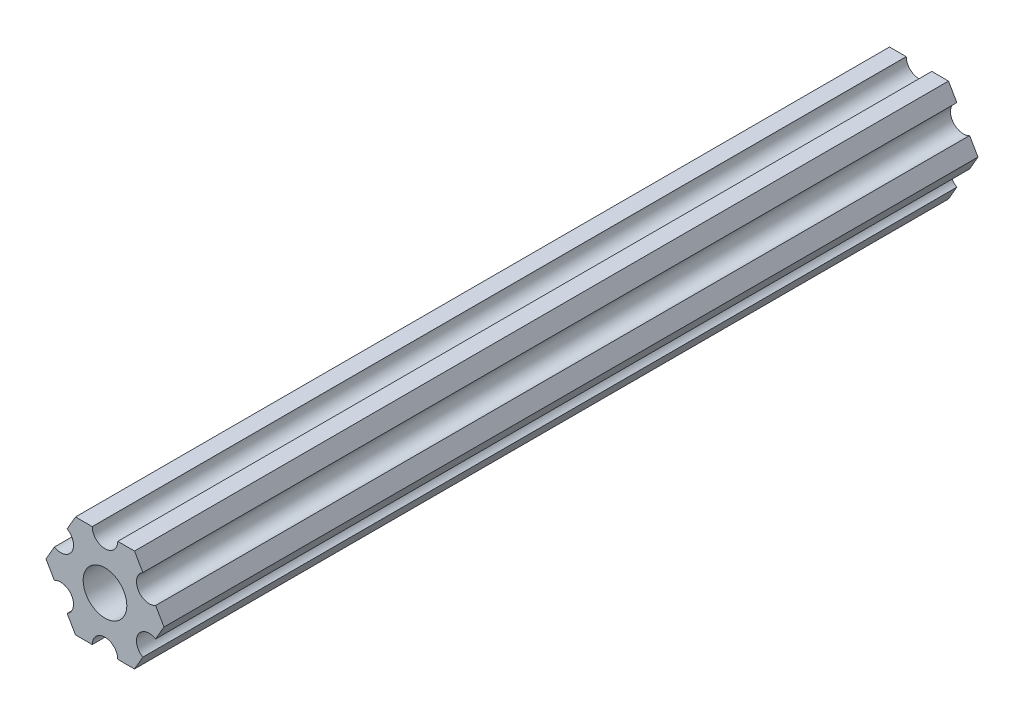
ISO-10303-21;
HEADER;
FILE_DESCRIPTION(('STEP AP214'),'2;1');
FILE_NAME('part.step','',(''),(''),'','','');
FILE_SCHEMA(('AUTOMOTIVE_DESIGN { 1 0 10303 214 1 1 1 1 }'));
ENDSEC;
DATA;
#1=APPLICATION_CONTEXT('core data for automotive mechanical design processes');
#2=APPLICATION_PROTOCOL_DEFINITION('international standard','automotive_design',2000,#1);
#3=PRODUCT_CONTEXT('',#1,'mechanical');
#4=PRODUCT('Part','Part','',(#3));
#5=PRODUCT_RELATED_PRODUCT_CATEGORY('part','',(#4));
#6=PRODUCT_DEFINITION_FORMATION('','',#4);
#7=PRODUCT_DEFINITION_CONTEXT('part definition',#1,'design');
#8=PRODUCT_DEFINITION('design','',#6,#7);
#9=PRODUCT_DEFINITION_SHAPE('','',#8);
#10=(LENGTH_UNIT() NAMED_UNIT(*) SI_UNIT(.MILLI.,.METRE.));
#11=(NAMED_UNIT(*) PLANE_ANGLE_UNIT() SI_UNIT($,.RADIAN.));
#12=(NAMED_UNIT(*) SI_UNIT($,.STERADIAN.) SOLID_ANGLE_UNIT());
#13=UNCERTAINTY_MEASURE_WITH_UNIT(LENGTH_MEASURE(1.E-05),#10,'distance_accuracy_value','');
#14=(GEOMETRIC_REPRESENTATION_CONTEXT(3) GLOBAL_UNCERTAINTY_ASSIGNED_CONTEXT((#13)) GLOBAL_UNIT_ASSIGNED_CONTEXT((#10,
#11,#12)) REPRESENTATION_CONTEXT('',''));
#15=CARTESIAN_POINT('',(0.,0.,0.));
#16=DIRECTION('',(0.,0.,1.));
#17=DIRECTION('',(1.,0.,0.));
#18=AXIS2_PLACEMENT_3D('',#15,#16,#17);
#19=CARTESIAN_POINT('',(-5.17787609367026,-2.98944773825908,-95.25));
#20=DIRECTION('',(0.,0.,1.));
#21=DIRECTION('',(1.,0.,0.));
#22=AXIS2_PLACEMENT_3D('',#19,#20,#21);
#23=CYLINDRICAL_SURFACE('',#22,1.49472402597403);
#24=CARTESIAN_POINT('',(-5.17787609367026,-2.98944773825908,0.));
#25=DIRECTION('',(0.,0.,-1.));
#26=DIRECTION('',(-1.,0.,0.));
#27=AXIS2_PLACEMENT_3D('',#24,#25,#26);
#28=CIRCLE('',#27,1.49472402597403);
#29=CARTESIAN_POINT('',(-5.92523802823502,-1.6949787148415,0.));
#30=VERTEX_POINT('',#29);
#31=CARTESIAN_POINT('',(-4.43051415910551,-4.28391676167665,0.));
#32=VERTEX_POINT('',#31);
#33=EDGE_CURVE('E196',#30,#32,#28,.T.);
#34=ORIENTED_EDGE('',*,*,#33,.F.);
#35=DIRECTION('',(0.,0.,1.));
#36=VECTOR('',#35,1.);
#37=CARTESIAN_POINT('',(-5.92523802823502,-1.6949787148415,-95.25));
#38=LINE('',#37,#36);
#39=CARTESIAN_POINT('',(-5.92523802823502,-1.6949787148415,-95.25));
#40=VERTEX_POINT('',#39);
#41=EDGE_CURVE('E11',#40,#30,#38,.T.);
#42=ORIENTED_EDGE('',*,*,#41,.F.);
#43=CARTESIAN_POINT('',(-5.17787609367026,-2.98944773825908,-95.25));
#44=DIRECTION('',(0.,0.,-1.));
#45=DIRECTION('',(-1.,0.,0.));
#46=AXIS2_PLACEMENT_3D('',#43,#44,#45);
#47=CIRCLE('',#46,1.49472402597403);
#48=CARTESIAN_POINT('',(-4.43051415910551,-4.28391676167665,-95.25));
#49=VERTEX_POINT('',#48);
#50=EDGE_CURVE('E247',#40,#49,#47,.T.);
#51=ORIENTED_EDGE('',*,*,#50,.T.);
#52=DIRECTION('',(0.,0.,1.));
#53=VECTOR('',#52,1.);
#54=CARTESIAN_POINT('',(-4.43051415910551,-4.28391676167665,-95.25));
#55=LINE('',#54,#53);
#56=EDGE_CURVE('E42',#49,#32,#55,.T.);
#57=ORIENTED_EDGE('',*,*,#56,.T.);
#58=EDGE_LOOP('',(#34,#42,#51,#57));
#59=FACE_BOUND('',#58,.T.);
#60=ADVANCED_FACE('F39',(#59),#23,.F.);
#61=CARTESIAN_POINT('',(-6.90383455008246,4.18252046975626E-07,-95.25));
#62=DIRECTION('',(-0.866025434075723,-0.499999947533953,0.));
#63=DIRECTION('',(0.499999947533953,-0.866025434075723,0.));
#64=AXIS2_PLACEMENT_3D('',#61,#62,#63);
#65=PLANE('',#64);
#66=DIRECTION('',(0.499999947533953,-0.866025434075723,0.));
#67=VECTOR('',#66,1.);
#68=CARTESIAN_POINT('',(-6.90383455008246,4.18252046975626E-07,0.));
#69=LINE('',#68,#67);
#70=CARTESIAN_POINT('',(-6.90383455008246,4.18252046975626E-07,0.));
#71=VERTEX_POINT('',#70);
#72=EDGE_CURVE('E245',#71,#30,#69,.T.);
#73=ORIENTED_EDGE('',*,*,#72,.F.);
#74=DIRECTION('',(0.,0.,1.));
#75=VECTOR('',#74,1.);
#76=CARTESIAN_POINT('',(-6.90383455008246,4.18252046975626E-07,-95.25));
#77=LINE('',#76,#75);
#78=CARTESIAN_POINT('',(-6.90383455008246,4.18252046975626E-07,-95.25));
#79=VERTEX_POINT('',#78);
#80=EDGE_CURVE('E48',#79,#71,#77,.T.);
#81=ORIENTED_EDGE('',*,*,#80,.F.);
#82=DIRECTION('',(0.499999947533953,-0.866025434075723,0.));
#83=VECTOR('',#82,1.);
#84=CARTESIAN_POINT('',(-6.90383455008246,4.18252046975626E-07,-95.25));
#85=LINE('',#84,#83);
#86=EDGE_CURVE('E186',#79,#40,#85,.T.);
#87=ORIENTED_EDGE('',*,*,#86,.T.);
#88=ORIENTED_EDGE('',*,*,#41,.T.);
#89=EDGE_LOOP('',(#73,#81,#87,#88));
#90=FACE_BOUND('',#89,.T.);
#91=ADVANCED_FACE('F279',(#90),#65,.T.);
#92=CARTESIAN_POINT('',(-5.92523782286267,1.69497943277368,-95.25));
#93=DIRECTION('',(-0.866025373493145,0.500000052466056,0.));
#94=DIRECTION('',(-0.500000052466056,-0.866025373493145,0.));
#95=AXIS2_PLACEMENT_3D('',#92,#93,#94);
#96=PLANE('',#95);
#97=DIRECTION('',(-0.500000052466056,-0.866025373493145,0.));
#98=VECTOR('',#97,1.);
#99=CARTESIAN_POINT('',(-5.92523782286267,1.69497943277368,0.));
#100=LINE('',#99,#98);
#101=CARTESIAN_POINT('',(-5.92523782286267,1.69497943277368,0.));
#102=VERTEX_POINT('',#101);
#103=EDGE_CURVE('E173',#102,#71,#100,.T.);
#104=ORIENTED_EDGE('',*,*,#103,.F.);
#105=DIRECTION('',(0.,0.,1.));
#106=VECTOR('',#105,1.);
#107=CARTESIAN_POINT('',(-5.92523782286267,1.69497943277368,-95.25));
#108=LINE('',#107,#106);
#109=CARTESIAN_POINT('',(-5.92523782286267,1.69497943277368,-95.25));
#110=VERTEX_POINT('',#109);
#111=EDGE_CURVE('E168',#110,#102,#108,.T.);
#112=ORIENTED_EDGE('',*,*,#111,.F.);
#113=DIRECTION('',(-0.500000052466056,-0.866025373493145,0.));
#114=VECTOR('',#113,1.);
#115=CARTESIAN_POINT('',(-5.92523782286267,1.69497943277368,-95.25));
#116=LINE('',#115,#114);
#117=EDGE_CURVE('E171',#110,#79,#116,.T.);
#118=ORIENTED_EDGE('',*,*,#117,.T.);
#119=ORIENTED_EDGE('',*,*,#80,.T.);
#120=EDGE_LOOP('',(#104,#112,#118,#119));
#121=FACE_BOUND('',#120,.T.);
#122=ADVANCED_FACE('F170',(#121),#96,.T.);
#123=CARTESIAN_POINT('',(-5.17787573145338,2.98944836563702,-95.25));
#124=DIRECTION('',(0.,0.,1.));
#125=DIRECTION('',(1.,0.,0.));
#126=AXIS2_PLACEMENT_3D('',#123,#124,#125);
#127=CYLINDRICAL_SURFACE('',#126,1.49472402597403);
#128=CARTESIAN_POINT('',(-5.17787573145338,2.98944836563702,0.));
#129=DIRECTION('',(0.,0.,-1.));
#130=DIRECTION('',(-1.,0.,0.));
#131=AXIS2_PLACEMENT_3D('',#128,#129,#130);
#132=CIRCLE('',#131,1.49472402597403);
#133=CARTESIAN_POINT('',(-4.43051364004409,4.28391729850035,0.));
#134=VERTEX_POINT('',#133);
#135=EDGE_CURVE('E242',#134,#102,#132,.T.);
#136=ORIENTED_EDGE('',*,*,#135,.F.);
#137=DIRECTION('',(0.,0.,1.));
#138=VECTOR('',#137,1.);
#139=CARTESIAN_POINT('',(-4.43051364004409,4.28391729850035,-95.25));
#140=LINE('',#139,#138);
#141=CARTESIAN_POINT('',(-4.43051364004409,4.28391729850035,-95.25));
#142=VERTEX_POINT('',#141);
#143=EDGE_CURVE('E178',#142,#134,#140,.T.);
#144=ORIENTED_EDGE('',*,*,#143,.F.);
#145=CARTESIAN_POINT('',(-5.17787573145338,2.98944836563702,-95.25));
#146=DIRECTION('',(0.,0.,-1.));
#147=DIRECTION('',(-1.,0.,0.));
#148=AXIS2_PLACEMENT_3D('',#145,#146,#147);
#149=CIRCLE('',#148,1.49472402597403);
#150=EDGE_CURVE('E184',#142,#110,#149,.T.);
#151=ORIENTED_EDGE('',*,*,#150,.T.);
#152=ORIENTED_EDGE('',*,*,#111,.T.);
#153=EDGE_LOOP('',(#136,#144,#151,#152));
#154=FACE_BOUND('',#153,.T.);
#155=ADVANCED_FACE('F188',(#154),#127,.F.);
#156=CARTESIAN_POINT('',(-3.45191691282425,5.97889631302209,-95.25));
#157=DIRECTION('',(-0.866025373493145,0.500000052466056,0.));
#158=DIRECTION('',(-0.500000052466056,-0.866025373493145,0.));
#159=AXIS2_PLACEMENT_3D('',#156,#157,#158);
#160=PLANE('',#159);
#161=DIRECTION('',(-0.500000052466056,-0.866025373493145,0.));
#162=VECTOR('',#161,1.);
#163=CARTESIAN_POINT('',(-3.45191691282425,5.97889631302209,0.));
#164=LINE('',#163,#162);
#165=CARTESIAN_POINT('',(-3.45191691282425,5.97889631302209,0.));
#166=VERTEX_POINT('',#165);
#167=EDGE_CURVE('E239',#166,#134,#164,.T.);
#168=ORIENTED_EDGE('',*,*,#167,.F.);
#169=DIRECTION('',(0.,0.,1.));
#170=VECTOR('',#169,1.);
#171=CARTESIAN_POINT('',(-3.45191691282425,5.97889631302209,-95.25));
#172=LINE('',#171,#170);
#173=CARTESIAN_POINT('',(-3.45191691282425,5.97889631302209,-95.25));
#174=VERTEX_POINT('',#173);
#175=EDGE_CURVE('E251',#174,#166,#172,.T.);
#176=ORIENTED_EDGE('',*,*,#175,.F.);
#177=DIRECTION('',(-0.500000052466056,-0.866025373493145,0.));
#178=VECTOR('',#177,1.);
#179=CARTESIAN_POINT('',(-3.45191691282425,5.97889631302209,-95.25));
#180=LINE('',#179,#178);
#181=EDGE_CURVE('E189',#174,#142,#180,.T.);
#182=ORIENTED_EDGE('',*,*,#181,.T.);
#183=ORIENTED_EDGE('',*,*,#143,.T.);
#184=EDGE_LOOP('',(#168,#176,#182,#183));
#185=FACE_BOUND('',#184,.T.);
#186=ADVANCED_FACE('F292',(#185),#160,.T.);
#187=CARTESIAN_POINT('',(-1.49472004158796,5.9788963130221,-95.25));
#188=DIRECTION('',(0.,1.,0.));
#189=DIRECTION('',(-1.,0.,0.));
#190=AXIS2_PLACEMENT_3D('',#187,#188,#189);
#191=PLANE('',#190);
#192=DIRECTION('',(-1.,0.,0.));
#193=VECTOR('',#192,1.);
#194=CARTESIAN_POINT('',(-1.49472004158796,5.9788963130221,0.));
#195=LINE('',#194,#193);
#196=CARTESIAN_POINT('',(-1.49472004158796,5.9788963130221,0.));
#197=VERTEX_POINT('',#196);
#198=EDGE_CURVE('E236',#197,#166,#195,.T.);
#199=ORIENTED_EDGE('',*,*,#198,.F.);
#200=DIRECTION('',(0.,0.,1.));
#201=VECTOR('',#200,1.);
#202=CARTESIAN_POINT('',(-1.49472004158796,5.9788963130221,-95.25));
#203=LINE('',#202,#201);
#204=CARTESIAN_POINT('',(-1.49472004158796,5.9788963130221,-95.25));
#205=VERTEX_POINT('',#204);
#206=EDGE_CURVE('E253',#205,#197,#203,.T.);
#207=ORIENTED_EDGE('',*,*,#206,.F.);
#208=DIRECTION('',(-1.,0.,0.));
#209=VECTOR('',#208,1.);
#210=CARTESIAN_POINT('',(-1.49472004158796,5.9788963130221,-95.25));
#211=LINE('',#210,#209);
#212=EDGE_CURVE('E191',#205,#174,#211,.T.);
#213=ORIENTED_EDGE('',*,*,#212,.T.);
#214=ORIENTED_EDGE('',*,*,#175,.T.);
#215=EDGE_LOOP('',(#199,#207,#213,#214));
#216=FACE_BOUND('',#215,.T.);
#217=ADVANCED_FACE('F295',(#216),#191,.T.);
#218=CARTESIAN_POINT('',(3.6221691569129E-07,5.9788963130221,-95.25));
#219=DIRECTION('',(0.,0.,1.));
#220=DIRECTION('',(1.,0.,0.));
#221=AXIS2_PLACEMENT_3D('',#218,#219,#220);
#222=CYLINDRICAL_SURFACE('',#221,1.49472004158796);
#223=CARTESIAN_POINT('',(3.6221691569129E-07,5.9788963130221,0.));
#224=DIRECTION('',(0.,0.,-1.));
#225=DIRECTION('',(-1.,0.,0.));
#226=AXIS2_PLACEMENT_3D('',#223,#224,#225);
#227=CIRCLE('',#226,1.49472004158796);
#228=CARTESIAN_POINT('',(1.49472040380487,5.9788963130221,0.));
#229=VERTEX_POINT('',#228);
#230=EDGE_CURVE('E233',#229,#197,#227,.T.);
#231=ORIENTED_EDGE('',*,*,#230,.F.);
#232=DIRECTION('',(0.,0.,1.));
#233=VECTOR('',#232,1.);
#234=CARTESIAN_POINT('',(1.49472040380487,5.9788963130221,-95.25));
#235=LINE('',#234,#233);
#236=CARTESIAN_POINT('',(1.49472040380487,5.9788963130221,-95.25));
#237=VERTEX_POINT('',#236);
#238=EDGE_CURVE('E255',#237,#229,#235,.T.);
#239=ORIENTED_EDGE('',*,*,#238,.F.);
#240=CARTESIAN_POINT('',(3.6221691569129E-07,5.9788963130221,-95.25));
#241=DIRECTION('',(0.,0.,-1.));
#242=DIRECTION('',(-1.,0.,0.));
#243=AXIS2_PLACEMENT_3D('',#240,#241,#242);
#244=CIRCLE('',#243,1.49472004158796);
#245=EDGE_CURVE('E400',#237,#205,#244,.T.);
#246=ORIENTED_EDGE('',*,*,#245,.T.);
#247=ORIENTED_EDGE('',*,*,#206,.T.);
#248=EDGE_LOOP('',(#231,#239,#246,#247));
#249=FACE_BOUND('',#248,.T.);
#250=ADVANCED_FACE('F299',(#249),#222,.F.);
#251=CARTESIAN_POINT('',(3.45191756880075,5.9788963130221,-95.25));
#252=DIRECTION('',(0.,1.,0.));
#253=DIRECTION('',(-1.,0.,0.));
#254=AXIS2_PLACEMENT_3D('',#251,#252,#253);
#255=PLANE('',#254);
#256=DIRECTION('',(-1.,0.,0.));
#257=VECTOR('',#256,1.);
#258=CARTESIAN_POINT('',(3.45191756880075,5.9788963130221,0.));
#259=LINE('',#258,#257);
#260=CARTESIAN_POINT('',(3.45191756880075,5.9788963130221,0.));
#261=VERTEX_POINT('',#260);
#262=EDGE_CURVE('E230',#261,#229,#259,.T.);
#263=ORIENTED_EDGE('',*,*,#262,.F.);
#264=DIRECTION('',(0.,0.,1.));
#265=VECTOR('',#264,1.);
#266=CARTESIAN_POINT('',(3.45191756880075,5.9788963130221,-95.25));
#267=LINE('',#266,#265);
#268=CARTESIAN_POINT('',(3.45191756880075,5.9788963130221,-95.25));
#269=VERTEX_POINT('',#268);
#270=EDGE_CURVE('E257',#269,#261,#267,.T.);
#271=ORIENTED_EDGE('',*,*,#270,.F.);
#272=DIRECTION('',(-1.,0.,0.));
#273=VECTOR('',#272,1.);
#274=CARTESIAN_POINT('',(3.45191756880075,5.9788963130221,-95.25));
#275=LINE('',#274,#273);
#276=EDGE_CURVE('E397',#269,#237,#275,.T.);
#277=ORIENTED_EDGE('',*,*,#276,.T.);
#278=ORIENTED_EDGE('',*,*,#238,.T.);
#279=EDGE_LOOP('',(#263,#271,#277,#278));
#280=FACE_BOUND('',#279,.T.);
#281=ADVANCED_FACE('F303',(#280),#255,.T.);
#282=CARTESIAN_POINT('',(4.43051400650963,4.28391720708899,-95.25));
#283=DIRECTION('',(0.866025449221368,0.499999921300922,0.));
#284=DIRECTION('',(-0.499999921300922,0.866025449221368,0.));
#285=AXIS2_PLACEMENT_3D('',#282,#283,#284);
#286=PLANE('',#285);
#287=DIRECTION('',(-0.499999921300922,0.866025449221368,0.));
#288=VECTOR('',#287,1.);
#289=CARTESIAN_POINT('',(4.43051400650963,4.28391720708899,0.));
#290=LINE('',#289,#288);
#291=CARTESIAN_POINT('',(4.43051400650963,4.28391720708899,0.));
#292=VERTEX_POINT('',#291);
#293=EDGE_CURVE('E227',#292,#261,#290,.T.);
#294=ORIENTED_EDGE('',*,*,#293,.F.);
#295=DIRECTION('',(0.,0.,1.));
#296=VECTOR('',#295,1.);
#297=CARTESIAN_POINT('',(4.43051400650963,4.28391720708899,-95.25));
#298=LINE('',#297,#296);
#299=CARTESIAN_POINT('',(4.43051400650963,4.28391720708899,-95.25));
#300=VERTEX_POINT('',#299);
#301=EDGE_CURVE('E259',#300,#292,#298,.T.);
#302=ORIENTED_EDGE('',*,*,#301,.F.);
#303=DIRECTION('',(-0.499999921300922,0.866025449221368,0.));
#304=VECTOR('',#303,1.);
#305=CARTESIAN_POINT('',(4.43051400650963,4.28391720708899,-95.25));
#306=LINE('',#305,#304);
#307=EDGE_CURVE('E394',#300,#269,#306,.T.);
#308=ORIENTED_EDGE('',*,*,#307,.T.);
#309=ORIENTED_EDGE('',*,*,#270,.T.);
#310=EDGE_LOOP('',(#294,#302,#308,#309));
#311=FACE_BOUND('',#310,.T.);
#312=ADVANCED_FACE('F307',(#311),#286,.T.);
#313=CARTESIAN_POINT('',(5.17787590186324,2.98944816103287,-95.25));
#314=DIRECTION('',(0.,0.,1.));
#315=DIRECTION('',(1.,0.,0.));
#316=AXIS2_PLACEMENT_3D('',#313,#314,#315);
#317=CYLINDRICAL_SURFACE('',#316,1.49472402597403);
#318=CARTESIAN_POINT('',(5.17787590186324,2.98944816103287,0.));
#319=DIRECTION('',(0.,0.,-1.));
#320=DIRECTION('',(-1.,0.,0.));
#321=AXIS2_PLACEMENT_3D('',#318,#319,#320);
#322=CIRCLE('',#321,1.49472402597403);
#323=CARTESIAN_POINT('',(5.92523779721685,1.69497911497674,0.));
#324=VERTEX_POINT('',#323);
#325=EDGE_CURVE('E224',#324,#292,#322,.T.);
#326=ORIENTED_EDGE('',*,*,#325,.F.);
#327=DIRECTION('',(0.,0.,1.));
#328=VECTOR('',#327,1.);
#329=CARTESIAN_POINT('',(5.92523779721685,1.69497911497674,-95.25));
#330=LINE('',#329,#328);
#331=CARTESIAN_POINT('',(5.92523779721685,1.69497911497674,-95.25));
#332=VERTEX_POINT('',#331);
#333=EDGE_CURVE('E261',#332,#324,#330,.T.);
#334=ORIENTED_EDGE('',*,*,#333,.F.);
#335=CARTESIAN_POINT('',(5.17787590186324,2.98944816103287,-95.25));
#336=DIRECTION('',(0.,0.,-1.));
#337=DIRECTION('',(-1.,0.,0.));
#338=AXIS2_PLACEMENT_3D('',#335,#336,#337);
#339=CIRCLE('',#338,1.49472402597403);
#340=EDGE_CURVE('E391',#332,#300,#339,.T.);
#341=ORIENTED_EDGE('',*,*,#340,.T.);
#342=ORIENTED_EDGE('',*,*,#301,.T.);
#343=EDGE_LOOP('',(#326,#334,#341,#342));
#344=FACE_BOUND('',#343,.T.);
#345=ADVANCED_FACE('F311',(#344),#317,.F.);
#346=CARTESIAN_POINT('',(6.90383418786557,9.05542295436252E-08,-95.25));
#347=DIRECTION('',(0.866025449221368,0.499999921300922,0.));
#348=DIRECTION('',(-0.499999921300922,0.866025449221368,0.));
#349=AXIS2_PLACEMENT_3D('',#346,#347,#348);
#350=PLANE('',#349);
#351=DIRECTION('',(-0.499999921300922,0.866025449221368,0.));
#352=VECTOR('',#351,1.);
#353=CARTESIAN_POINT('',(6.90383418786557,9.05542295436252E-08,0.));
#354=LINE('',#353,#352);
#355=CARTESIAN_POINT('',(6.90383418786557,9.05542295436252E-08,0.));
#356=VERTEX_POINT('',#355);
#357=EDGE_CURVE('E221',#356,#324,#354,.T.);
#358=ORIENTED_EDGE('',*,*,#357,.F.);
#359=DIRECTION('',(0.,0.,1.));
#360=VECTOR('',#359,1.);
#361=CARTESIAN_POINT('',(6.90383418786557,9.05542295436252E-08,-95.25));
#362=LINE('',#361,#360);
#363=CARTESIAN_POINT('',(6.90383418786557,9.05542295436252E-08,-95.25));
#364=VERTEX_POINT('',#363);
#365=EDGE_CURVE('E263',#364,#356,#362,.T.);
#366=ORIENTED_EDGE('',*,*,#365,.F.);
#367=DIRECTION('',(-0.499999921300922,0.866025449221368,0.));
#368=VECTOR('',#367,1.);
#369=CARTESIAN_POINT('',(6.90383418786557,9.05542295436252E-08,-95.25));
#370=LINE('',#369,#368);
#371=EDGE_CURVE('E388',#364,#332,#370,.T.);
#372=ORIENTED_EDGE('',*,*,#371,.T.);
#373=ORIENTED_EDGE('',*,*,#333,.T.);
#374=EDGE_LOOP('',(#358,#366,#372,#373));
#375=FACE_BOUND('',#374,.T.);
#376=ADVANCED_FACE('F315',(#375),#350,.T.);
#377=CARTESIAN_POINT('',(5.92523756333199,-1.69497898325332,-95.25));
#378=DIRECTION('',(0.866025403784438,-0.5,0.));
#379=DIRECTION('',(0.5,0.866025403784438,0.));
#380=AXIS2_PLACEMENT_3D('',#377,#378,#379);
#381=PLANE('',#380);
#382=DIRECTION('',(0.5,0.866025403784439,0.));
#383=VECTOR('',#382,1.);
#384=CARTESIAN_POINT('',(5.92523756333199,-1.69497898325332,0.));
#385=LINE('',#384,#383);
#386=CARTESIAN_POINT('',(5.92523756333199,-1.69497898325332,0.));
#387=VERTEX_POINT('',#386);
#388=EDGE_CURVE('E218',#387,#356,#385,.T.);
#389=ORIENTED_EDGE('',*,*,#388,.F.);
#390=DIRECTION('',(0.,0.,1.));
#391=VECTOR('',#390,1.);
#392=CARTESIAN_POINT('',(5.92523756333199,-1.69497898325332,-95.25));
#393=LINE('',#392,#391);
#394=CARTESIAN_POINT('',(5.92523756333199,-1.69497898325332,-95.25));
#395=VERTEX_POINT('',#394);
#396=EDGE_CURVE('E265',#395,#387,#393,.T.);
#397=ORIENTED_EDGE('',*,*,#396,.F.);
#398=DIRECTION('',(0.5,0.866025403784439,0.));
#399=VECTOR('',#398,1.);
#400=CARTESIAN_POINT('',(5.92523756333199,-1.69497898325332,-95.25));
#401=LINE('',#400,#399);
#402=EDGE_CURVE('E385',#395,#364,#401,.T.);
#403=ORIENTED_EDGE('',*,*,#402,.T.);
#404=ORIENTED_EDGE('',*,*,#365,.T.);
#405=EDGE_LOOP('',(#389,#397,#403,#404));
#406=FACE_BOUND('',#405,.T.);
#407=ADVANCED_FACE('F319',(#406),#381,.T.);
#408=CARTESIAN_POINT('',(5.17787555034498,-2.98944796139378,-95.25));
#409=DIRECTION('',(0.,0.,1.));
#410=DIRECTION('',(1.,0.,0.));
#411=AXIS2_PLACEMENT_3D('',#408,#409,#410);
#412=CYLINDRICAL_SURFACE('',#411,1.49472402597403);
#413=CARTESIAN_POINT('',(5.17787555034498,-2.98944796139378,0.));
#414=DIRECTION('',(0.,0.,-1.));
#415=DIRECTION('',(-1.,0.,0.));
#416=AXIS2_PLACEMENT_3D('',#413,#414,#415);
#417=CIRCLE('',#416,1.49472402597403);
#418=CARTESIAN_POINT('',(4.43051353735797,-4.28391693953424,0.));
#419=VERTEX_POINT('',#418);
#420=EDGE_CURVE('E215',#419,#387,#417,.T.);
#421=ORIENTED_EDGE('',*,*,#420,.F.);
#422=DIRECTION('',(0.,0.,1.));
#423=VECTOR('',#422,1.);
#424=CARTESIAN_POINT('',(4.43051353735797,-4.28391693953424,-95.25));
#425=LINE('',#424,#423);
#426=CARTESIAN_POINT('',(4.43051353735797,-4.28391693953424,-95.25));
#427=VERTEX_POINT('',#426);
#428=EDGE_CURVE('E267',#427,#419,#425,.T.);
#429=ORIENTED_EDGE('',*,*,#428,.F.);
#430=CARTESIAN_POINT('',(5.17787555034498,-2.98944796139378,-95.25));
#431=DIRECTION('',(0.,0.,-1.));
#432=DIRECTION('',(-1.,0.,0.));
#433=AXIS2_PLACEMENT_3D('',#430,#431,#432);
#434=CIRCLE('',#433,1.49472402597403);
#435=EDGE_CURVE('E382',#427,#395,#434,.T.);
#436=ORIENTED_EDGE('',*,*,#435,.T.);
#437=ORIENTED_EDGE('',*,*,#396,.T.);
#438=EDGE_LOOP('',(#421,#429,#436,#437));
#439=FACE_BOUND('',#438,.T.);
#440=ADVANCED_FACE('F323',(#439),#412,.F.);
#441=CARTESIAN_POINT('',(3.45191691282433,-5.9788960133419,-95.25));
#442=DIRECTION('',(0.866025403784438,-0.5,0.));
#443=DIRECTION('',(0.5,0.866025403784438,0.));
#444=AXIS2_PLACEMENT_3D('',#441,#442,#443);
#445=PLANE('',#444);
#446=DIRECTION('',(0.5,0.866025403784438,0.));
#447=VECTOR('',#446,1.);
#448=CARTESIAN_POINT('',(3.45191691282433,-5.9788960133419,0.));
#449=LINE('',#448,#447);
#450=CARTESIAN_POINT('',(3.45191691282433,-5.9788960133419,0.));
#451=VERTEX_POINT('',#450);
#452=EDGE_CURVE('E212',#451,#419,#449,.T.);
#453=ORIENTED_EDGE('',*,*,#452,.F.);
#454=DIRECTION('',(0.,0.,1.));
#455=VECTOR('',#454,1.);
#456=CARTESIAN_POINT('',(3.45191691282433,-5.9788960133419,-95.25));
#457=LINE('',#456,#455);
#458=CARTESIAN_POINT('',(3.45191691282433,-5.9788960133419,-95.25));
#459=VERTEX_POINT('',#458);
#460=EDGE_CURVE('E269',#459,#451,#457,.T.);
#461=ORIENTED_EDGE('',*,*,#460,.F.);
#462=DIRECTION('',(0.5,0.866025403784438,0.));
#463=VECTOR('',#462,1.);
#464=CARTESIAN_POINT('',(3.45191691282433,-5.9788960133419,-95.25));
#465=LINE('',#464,#463);
#466=EDGE_CURVE('E379',#459,#427,#465,.T.);
#467=ORIENTED_EDGE('',*,*,#466,.T.);
#468=ORIENTED_EDGE('',*,*,#428,.T.);
#469=EDGE_LOOP('',(#453,#461,#467,#468));
#470=FACE_BOUND('',#469,.T.);
#471=ADVANCED_FACE('F327',(#470),#445,.T.);
#472=CARTESIAN_POINT('',(1.49472801035924,-5.9788960133419,-95.25));
#473=DIRECTION('',(0.,-1.,0.));
#474=DIRECTION('',(1.,0.,0.));
#475=AXIS2_PLACEMENT_3D('',#472,#473,#474);
#476=PLANE('',#475);
#477=DIRECTION('',(1.,0.,0.));
#478=VECTOR('',#477,1.);
#479=CARTESIAN_POINT('',(1.49472801035924,-5.9788960133419,0.));
#480=LINE('',#479,#478);
#481=CARTESIAN_POINT('',(1.49472801035924,-5.9788960133419,0.));
#482=VERTEX_POINT('',#481);
#483=EDGE_CURVE('E209',#482,#451,#480,.T.);
#484=ORIENTED_EDGE('',*,*,#483,.F.);
#485=DIRECTION('',(0.,0.,1.));
#486=VECTOR('',#485,1.);
#487=CARTESIAN_POINT('',(1.49472801035924,-5.9788960133419,-95.25));
#488=LINE('',#487,#486);
#489=CARTESIAN_POINT('',(1.49472801035924,-5.9788960133419,-95.25));
#490=VERTEX_POINT('',#489);
#491=EDGE_CURVE('E271',#490,#482,#488,.T.);
#492=ORIENTED_EDGE('',*,*,#491,.F.);
#493=DIRECTION('',(1.,0.,0.));
#494=VECTOR('',#493,1.);
#495=CARTESIAN_POINT('',(1.49472801035924,-5.9788960133419,-95.25));
#496=LINE('',#495,#494);
#497=EDGE_CURVE('E376',#490,#459,#496,.T.);
#498=ORIENTED_EDGE('',*,*,#497,.T.);
#499=ORIENTED_EDGE('',*,*,#460,.T.);
#500=EDGE_LOOP('',(#484,#492,#498,#499));
#501=FACE_BOUND('',#500,.T.);
#502=ADVANCED_FACE('F331',(#501),#476,.T.);
#503=CARTESIAN_POINT('',(-3.62216837638295E-07,-5.9788960133419,-95.25));
#504=DIRECTION('',(0.,0.,1.));
#505=DIRECTION('',(1.,0.,0.));
#506=AXIS2_PLACEMENT_3D('',#503,#504,#505);
#507=CYLINDRICAL_SURFACE('',#506,1.49472801035924);
#508=CARTESIAN_POINT('',(-3.62216837638295E-07,-5.9788960133419,0.));
#509=DIRECTION('',(0.,0.,-1.));
#510=DIRECTION('',(-1.,0.,0.));
#511=AXIS2_PLACEMENT_3D('',#508,#509,#510);
#512=CIRCLE('',#511,1.49472801035924);
#513=CARTESIAN_POINT('',(-1.49472837257608,-5.9788960133419,0.));
#514=VERTEX_POINT('',#513);
#515=EDGE_CURVE('E206',#514,#482,#512,.T.);
#516=ORIENTED_EDGE('',*,*,#515,.F.);
#517=DIRECTION('',(0.,0.,1.));
#518=VECTOR('',#517,1.);
#519=CARTESIAN_POINT('',(-1.49472837257608,-5.9788960133419,-95.25));
#520=LINE('',#519,#518);
#521=CARTESIAN_POINT('',(-1.49472837257608,-5.9788960133419,-95.25));
#522=VERTEX_POINT('',#521);
#523=EDGE_CURVE('E273',#522,#514,#520,.T.);
#524=ORIENTED_EDGE('',*,*,#523,.F.);
#525=CARTESIAN_POINT('',(-3.62216837638295E-07,-5.9788960133419,-95.25));
#526=DIRECTION('',(0.,0.,-1.));
#527=DIRECTION('',(-1.,0.,0.));
#528=AXIS2_PLACEMENT_3D('',#525,#526,#527);
#529=CIRCLE('',#528,1.49472801035924);
#530=EDGE_CURVE('E373',#522,#490,#529,.T.);
#531=ORIENTED_EDGE('',*,*,#530,.T.);
#532=ORIENTED_EDGE('',*,*,#491,.T.);
#533=EDGE_LOOP('',(#516,#524,#531,#532));
#534=FACE_BOUND('',#533,.T.);
#535=ADVANCED_FACE('F335',(#534),#507,.F.);
#536=CARTESIAN_POINT('',(-3.45191756880068,-5.9788960133419,-95.25));
#537=DIRECTION('',(0.,-1.,0.));
#538=DIRECTION('',(1.,0.,0.));
#539=AXIS2_PLACEMENT_3D('',#536,#537,#538);
#540=PLANE('',#539);
#541=DIRECTION('',(1.,0.,0.));
#542=VECTOR('',#541,1.);
#543=CARTESIAN_POINT('',(-3.45191756880068,-5.9788960133419,0.));
#544=LINE('',#543,#542);
#545=CARTESIAN_POINT('',(-3.45191756880068,-5.9788960133419,0.));
#546=VERTEX_POINT('',#545);
#547=EDGE_CURVE('E203',#546,#514,#544,.T.);
#548=ORIENTED_EDGE('',*,*,#547,.F.);
#549=DIRECTION('',(0.,0.,1.));
#550=VECTOR('',#549,1.);
#551=CARTESIAN_POINT('',(-3.45191756880068,-5.9788960133419,-95.25));
#552=LINE('',#551,#550);
#553=CARTESIAN_POINT('',(-3.45191756880068,-5.9788960133419,-95.25));
#554=VERTEX_POINT('',#553);
#555=EDGE_CURVE('E274',#554,#546,#552,.T.);
#556=ORIENTED_EDGE('',*,*,#555,.F.);
#557=DIRECTION('',(1.,0.,0.));
#558=VECTOR('',#557,1.);
#559=CARTESIAN_POINT('',(-3.45191756880068,-5.9788960133419,-95.25));
#560=LINE('',#559,#558);
#561=EDGE_CURVE('E370',#554,#522,#560,.T.);
#562=ORIENTED_EDGE('',*,*,#561,.T.);
#563=ORIENTED_EDGE('',*,*,#523,.T.);
#564=EDGE_LOOP('',(#548,#556,#562,#563));
#565=FACE_BOUND('',#564,.T.);
#566=ADVANCED_FACE('F339',(#565),#540,.T.);
#567=CARTESIAN_POINT('',(-4.43051415910551,-4.28391676167665,-95.25));
#568=DIRECTION('',(-0.866025434075723,-0.499999947533953,0.));
#569=DIRECTION('',(0.499999947533953,-0.866025434075723,0.));
#570=AXIS2_PLACEMENT_3D('',#567,#568,#569);
#571=PLANE('',#570);
#572=DIRECTION('',(0.499999947533953,-0.866025434075723,0.));
#573=VECTOR('',#572,1.);
#574=CARTESIAN_POINT('',(-4.43051415910551,-4.28391676167665,0.));
#575=LINE('',#574,#573);
#576=EDGE_CURVE('E199',#32,#546,#575,.T.);
#577=ORIENTED_EDGE('',*,*,#576,.F.);
#578=ORIENTED_EDGE('',*,*,#56,.F.);
#579=DIRECTION('',(0.499999947533953,-0.866025434075723,0.));
#580=VECTOR('',#579,1.);
#581=CARTESIAN_POINT('',(-4.43051415910551,-4.28391676167665,-95.25));
#582=LINE('',#581,#580);
#583=EDGE_CURVE('E368',#49,#554,#582,.T.);
#584=ORIENTED_EDGE('',*,*,#583,.T.);
#585=ORIENTED_EDGE('',*,*,#555,.T.);
#586=EDGE_LOOP('',(#577,#578,#584,#585));
#587=FACE_BOUND('',#586,.T.);
#588=ADVANCED_FACE('F276',(#587),#571,.T.);
#589=CARTESIAN_POINT('',(-5.17787609367026,-2.98944773825908,-95.25));
#590=DIRECTION('',(0.,0.,-1.));
#591=DIRECTION('',(-1.,0.,0.));
#592=AXIS2_PLACEMENT_3D('',#589,#590,#591);
#593=PLANE('',#592);
#594=CARTESIAN_POINT('',(0.,0.,-95.25));
#595=DIRECTION('',(0.,0.,1.));
#596=DIRECTION('',(1.,0.,0.));
#597=AXIS2_PLACEMENT_3D('',#594,#595,#596);
#598=CIRCLE('',#597,2.55269999999998);
#599=CARTESIAN_POINT('',(2.55269999999998,0.,-95.25));
#600=VERTEX_POINT('',#599);
#601=EDGE_CURVE('E200',#600,#600,#598,.T.);
#602=ORIENTED_EDGE('',*,*,#601,.T.);
#603=EDGE_LOOP('',(#602));
#604=FACE_BOUND('',#603,.T.);
#605=ORIENTED_EDGE('',*,*,#50,.F.);
#606=ORIENTED_EDGE('',*,*,#86,.F.);
#607=ORIENTED_EDGE('',*,*,#117,.F.);
#608=ORIENTED_EDGE('',*,*,#150,.F.);
#609=ORIENTED_EDGE('',*,*,#181,.F.);
#610=ORIENTED_EDGE('',*,*,#212,.F.);
#611=ORIENTED_EDGE('',*,*,#245,.F.);
#612=ORIENTED_EDGE('',*,*,#276,.F.);
#613=ORIENTED_EDGE('',*,*,#307,.F.);
#614=ORIENTED_EDGE('',*,*,#340,.F.);
#615=ORIENTED_EDGE('',*,*,#371,.F.);
#616=ORIENTED_EDGE('',*,*,#402,.F.);
#617=ORIENTED_EDGE('',*,*,#435,.F.);
#618=ORIENTED_EDGE('',*,*,#466,.F.);
#619=ORIENTED_EDGE('',*,*,#497,.F.);
#620=ORIENTED_EDGE('',*,*,#530,.F.);
#621=ORIENTED_EDGE('',*,*,#561,.F.);
#622=ORIENTED_EDGE('',*,*,#583,.F.);
#623=EDGE_LOOP('',(#605,#606,#607,#608,#609,#610,#611,#612,#613,#614,#615,#616,#617,#618,#619,
#620,#621,#622));
#624=FACE_BOUND('',#623,.T.);
#625=ADVANCED_FACE('F182',(#604,#624),#593,.T.);
#626=CARTESIAN_POINT('',(-5.17787609367026,-2.98944773825908,0.));
#627=DIRECTION('',(0.,0.,-1.));
#628=DIRECTION('',(-1.,0.,0.));
#629=AXIS2_PLACEMENT_3D('',#626,#627,#628);
#630=PLANE('',#629);
#631=CARTESIAN_POINT('',(0.,0.,0.));
#632=DIRECTION('',(0.,0.,1.));
#633=DIRECTION('',(1.,0.,0.));
#634=AXIS2_PLACEMENT_3D('',#631,#632,#633);
#635=CIRCLE('',#634,2.55269999999999);
#636=CARTESIAN_POINT('',(2.55269999999999,0.,0.));
#637=VERTEX_POINT('',#636);
#638=EDGE_CURVE('E363',#637,#637,#635,.T.);
#639=ORIENTED_EDGE('',*,*,#638,.F.);
#640=EDGE_LOOP('',(#639));
#641=FACE_BOUND('',#640,.T.);
#642=ORIENTED_EDGE('',*,*,#33,.T.);
#643=ORIENTED_EDGE('',*,*,#576,.T.);
#644=ORIENTED_EDGE('',*,*,#547,.T.);
#645=ORIENTED_EDGE('',*,*,#515,.T.);
#646=ORIENTED_EDGE('',*,*,#483,.T.);
#647=ORIENTED_EDGE('',*,*,#452,.T.);
#648=ORIENTED_EDGE('',*,*,#420,.T.);
#649=ORIENTED_EDGE('',*,*,#388,.T.);
#650=ORIENTED_EDGE('',*,*,#357,.T.);
#651=ORIENTED_EDGE('',*,*,#325,.T.);
#652=ORIENTED_EDGE('',*,*,#293,.T.);
#653=ORIENTED_EDGE('',*,*,#262,.T.);
#654=ORIENTED_EDGE('',*,*,#230,.T.);
#655=ORIENTED_EDGE('',*,*,#198,.T.);
#656=ORIENTED_EDGE('',*,*,#167,.T.);
#657=ORIENTED_EDGE('',*,*,#135,.T.);
#658=ORIENTED_EDGE('',*,*,#103,.T.);
#659=ORIENTED_EDGE('',*,*,#72,.T.);
#660=EDGE_LOOP('',(#642,#643,#644,#645,#646,#647,#648,#649,#650,#651,#652,#653,#654,#655,#656,
#657,#658,#659));
#661=FACE_BOUND('',#660,.T.);
#662=ADVANCED_FACE('F278',(#641,#661),#630,.F.);
#663=CARTESIAN_POINT('',(0.,0.,0.));
#664=DIRECTION('',(0.,0.,1.));
#665=DIRECTION('',(1.,0.,0.));
#666=AXIS2_PLACEMENT_3D('',#663,#664,#665);
#667=CYLINDRICAL_SURFACE('',#666,2.55269999999998);
#668=ORIENTED_EDGE('',*,*,#601,.F.);
#669=EDGE_LOOP('',(#668));
#670=FACE_BOUND('',#669,.T.);
#671=ORIENTED_EDGE('',*,*,#638,.T.);
#672=EDGE_LOOP('',(#671));
#673=FACE_BOUND('',#672,.T.);
#674=ADVANCED_FACE('F351',(#670,#673),#667,.F.);
#675=CLOSED_SHELL('',(#60,#91,#122,#155,#186,#217,#250,#281,#312,#345,#376,#407,#440,#471,#502,
#535,#566,#588,#625,#662,#674));
#676=MANIFOLD_SOLID_BREP('B2',#675);
#677=ADVANCED_BREP_SHAPE_REPRESENTATION('',(#18,#676),#14);
#678=SHAPE_DEFINITION_REPRESENTATION(#9,#677);
ENDSEC;
END-ISO-10303-21;
